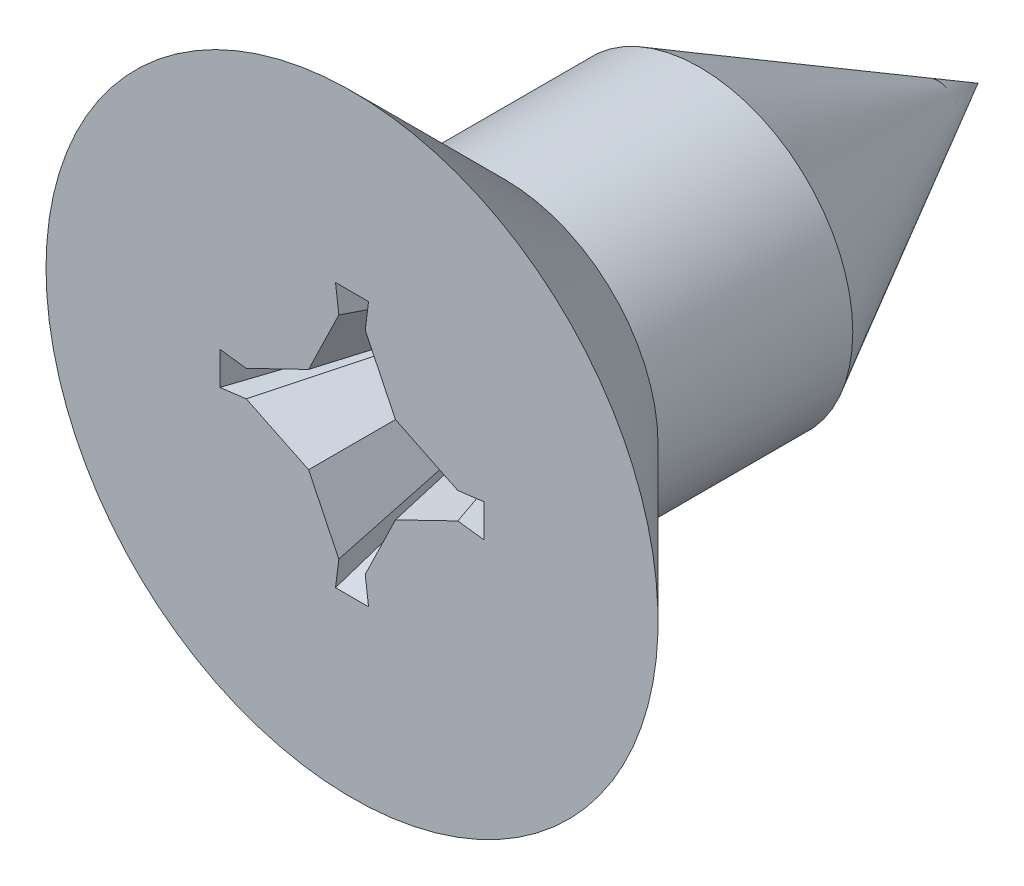
ISO-10303-21;
HEADER;
FILE_DESCRIPTION(('STEP AP214'),'2;1');
FILE_NAME('part.step','',(''),(''),'','','');
FILE_SCHEMA(('AUTOMOTIVE_DESIGN { 1 0 10303 214 1 1 1 1 }'));
ENDSEC;
DATA;
#1=APPLICATION_CONTEXT('core data for automotive mechanical design processes');
#2=APPLICATION_PROTOCOL_DEFINITION('international standard','automotive_design',2000,#1);
#3=PRODUCT_CONTEXT('',#1,'mechanical');
#4=PRODUCT('Part','Part','',(#3));
#5=PRODUCT_RELATED_PRODUCT_CATEGORY('part','',(#4));
#6=PRODUCT_DEFINITION_FORMATION('','',#4);
#7=PRODUCT_DEFINITION_CONTEXT('part definition',#1,'design');
#8=PRODUCT_DEFINITION('design','',#6,#7);
#9=PRODUCT_DEFINITION_SHAPE('','',#8);
#10=(LENGTH_UNIT() NAMED_UNIT(*) SI_UNIT(.MILLI.,.METRE.));
#11=(NAMED_UNIT(*) PLANE_ANGLE_UNIT() SI_UNIT($,.RADIAN.));
#12=(NAMED_UNIT(*) SI_UNIT($,.STERADIAN.) SOLID_ANGLE_UNIT());
#13=UNCERTAINTY_MEASURE_WITH_UNIT(LENGTH_MEASURE(1.E-05),#10,'distance_accuracy_value','');
#14=(GEOMETRIC_REPRESENTATION_CONTEXT(3) GLOBAL_UNCERTAINTY_ASSIGNED_CONTEXT((#13)) GLOBAL_UNIT_ASSIGNED_CONTEXT((#10,
#11,#12)) REPRESENTATION_CONTEXT('',''));
#15=CARTESIAN_POINT('',(0.,0.,0.));
#16=DIRECTION('',(0.,0.,1.));
#17=DIRECTION('',(1.,0.,0.));
#18=AXIS2_PLACEMENT_3D('',#15,#16,#17);
#19=CARTESIAN_POINT('',(0.,0.,1.1));
#20=DIRECTION('',(0.,0.,-1.));
#21=DIRECTION('',(-1.,0.,0.));
#22=AXIS2_PLACEMENT_3D('',#19,#20,#21);
#23=PLANE('',#22);
#24=CARTESIAN_POINT('',(0.,0.,1.1));
#25=DIRECTION('',(0.,0.,-1.));
#26=DIRECTION('',(-1.,0.,0.));
#27=AXIS2_PLACEMENT_3D('',#24,#25,#26);
#28=CIRCLE('',#27,2.2);
#29=CARTESIAN_POINT('',(-2.2,0.,1.1));
#30=VERTEX_POINT('',#29);
#31=EDGE_CURVE('E318',#30,#30,#28,.T.);
#32=ORIENTED_EDGE('',*,*,#31,.F.);
#33=EDGE_LOOP('',(#32));
#34=FACE_BOUND('',#33,.T.);
#35=DIRECTION('',(0.992277876713668,-0.124034734589208,0.));
#36=VECTOR('',#35,1.);
#37=CARTESIAN_POINT('',(0.855,-0.106875,1.1));
#38=LINE('',#37,#36);
#39=CARTESIAN_POINT('',(0.76,-0.095,1.1));
#40=VERTEX_POINT('',#39);
#41=CARTESIAN_POINT('',(0.95,-0.11875,1.1));
#42=VERTEX_POINT('',#41);
#43=EDGE_CURVE('E316',#40,#42,#38,.T.);
#44=ORIENTED_EDGE('',*,*,#43,.F.);
#45=DIRECTION('',(0.899748408578143,0.4364089839372,0.));
#46=VECTOR('',#45,1.);
#47=CARTESIAN_POINT('',(0.536099471867573,-0.203599471867572,1.1));
#48=LINE('',#47,#46);
#49=CARTESIAN_POINT('',(0.312198943735145,-0.312198943735145,1.1));
#50=VERTEX_POINT('',#49);
#51=EDGE_CURVE('E309',#50,#40,#48,.T.);
#52=ORIENTED_EDGE('',*,*,#51,.F.);
#53=DIRECTION('',(0.4364089839372,0.899748408578143,0.));
#54=VECTOR('',#53,1.);
#55=CARTESIAN_POINT('',(0.203599471867572,-0.536099471867573,1.1));
#56=LINE('',#55,#54);
#57=CARTESIAN_POINT('',(0.095,-0.76,1.1));
#58=VERTEX_POINT('',#57);
#59=EDGE_CURVE('E32',#58,#50,#56,.T.);
#60=ORIENTED_EDGE('',*,*,#59,.F.);
#61=DIRECTION('',(-0.124034734589209,0.992277876713668,0.));
#62=VECTOR('',#61,1.);
#63=CARTESIAN_POINT('',(0.106875,-0.855,1.1));
#64=LINE('',#63,#62);
#65=CARTESIAN_POINT('',(0.11875,-0.95,1.1));
#66=VERTEX_POINT('',#65);
#67=EDGE_CURVE('E295',#66,#58,#64,.T.);
#68=ORIENTED_EDGE('',*,*,#67,.F.);
#69=DIRECTION('',(1.,0.,0.));
#70=VECTOR('',#69,1.);
#71=CARTESIAN_POINT('',(-0.059375,-0.95,1.1));
#72=LINE('',#71,#70);
#73=CARTESIAN_POINT('',(-0.11875,-0.95,1.1));
#74=VERTEX_POINT('',#73);
#75=EDGE_CURVE('E285',#74,#66,#72,.T.);
#76=ORIENTED_EDGE('',*,*,#75,.F.);
#77=DIRECTION('',(-0.124034734589209,-0.992277876713668,0.));
#78=VECTOR('',#77,1.);
#79=CARTESIAN_POINT('',(-0.106875,-0.855,1.1));
#80=LINE('',#79,#78);
#81=CARTESIAN_POINT('',(-0.095,-0.76,1.1));
#82=VERTEX_POINT('',#81);
#83=EDGE_CURVE('E280',#82,#74,#80,.T.);
#84=ORIENTED_EDGE('',*,*,#83,.F.);
#85=DIRECTION('',(0.4364089839372,-0.899748408578143,0.));
#86=VECTOR('',#85,1.);
#87=CARTESIAN_POINT('',(-0.203599471867572,-0.536099471867573,1.1));
#88=LINE('',#87,#86);
#89=CARTESIAN_POINT('',(-0.312198943735145,-0.312198943735145,1.1));
#90=VERTEX_POINT('',#89);
#91=EDGE_CURVE('E272',#90,#82,#88,.T.);
#92=ORIENTED_EDGE('',*,*,#91,.F.);
#93=DIRECTION('',(0.899748408578143,-0.4364089839372,0.));
#94=VECTOR('',#93,1.);
#95=CARTESIAN_POINT('',(-0.536099471867573,-0.203599471867572,1.1));
#96=LINE('',#95,#94);
#97=CARTESIAN_POINT('',(-0.76,-0.095,1.1));
#98=VERTEX_POINT('',#97);
#99=EDGE_CURVE('E264',#98,#90,#96,.T.);
#100=ORIENTED_EDGE('',*,*,#99,.F.);
#101=DIRECTION('',(0.992277876713668,0.124034734589208,0.));
#102=VECTOR('',#101,1.);
#103=CARTESIAN_POINT('',(-0.855,-0.106875,1.1));
#104=LINE('',#103,#102);
#105=CARTESIAN_POINT('',(-0.95,-0.11875,1.1));
#106=VERTEX_POINT('',#105);
#107=EDGE_CURVE('E256',#106,#98,#104,.T.);
#108=ORIENTED_EDGE('',*,*,#107,.F.);
#109=DIRECTION('',(0.,-1.,0.));
#110=VECTOR('',#109,1.);
#111=CARTESIAN_POINT('',(-0.95,0.059375,1.1));
#112=LINE('',#111,#110);
#113=CARTESIAN_POINT('',(-0.95,0.11875,1.1));
#114=VERTEX_POINT('',#113);
#115=EDGE_CURVE('E246',#114,#106,#112,.T.);
#116=ORIENTED_EDGE('',*,*,#115,.F.);
#117=DIRECTION('',(-0.992277876713668,0.124034734589208,0.));
#118=VECTOR('',#117,1.);
#119=CARTESIAN_POINT('',(-0.855,0.106875,1.1));
#120=LINE('',#119,#118);
#121=CARTESIAN_POINT('',(-0.76,0.095,1.1));
#122=VERTEX_POINT('',#121);
#123=EDGE_CURVE('E241',#122,#114,#120,.T.);
#124=ORIENTED_EDGE('',*,*,#123,.F.);
#125=DIRECTION('',(-0.899748408578143,-0.4364089839372,0.));
#126=VECTOR('',#125,1.);
#127=CARTESIAN_POINT('',(-0.536099471867573,0.203599471867572,1.1));
#128=LINE('',#127,#126);
#129=CARTESIAN_POINT('',(-0.312198943735145,0.312198943735145,1.1));
#130=VERTEX_POINT('',#129);
#131=EDGE_CURVE('E233',#130,#122,#128,.T.);
#132=ORIENTED_EDGE('',*,*,#131,.F.);
#133=DIRECTION('',(-0.4364089839372,-0.899748408578143,0.));
#134=VECTOR('',#133,1.);
#135=CARTESIAN_POINT('',(-0.203599471867572,0.536099471867573,1.1));
#136=LINE('',#135,#134);
#137=CARTESIAN_POINT('',(-0.095,0.76,1.1));
#138=VERTEX_POINT('',#137);
#139=EDGE_CURVE('E225',#138,#130,#136,.T.);
#140=ORIENTED_EDGE('',*,*,#139,.F.);
#141=DIRECTION('',(0.124034734589209,-0.992277876713668,0.));
#142=VECTOR('',#141,1.);
#143=CARTESIAN_POINT('',(-0.106875,0.855,1.1));
#144=LINE('',#143,#142);
#145=CARTESIAN_POINT('',(-0.11875,0.95,1.1));
#146=VERTEX_POINT('',#145);
#147=EDGE_CURVE('E217',#146,#138,#144,.T.);
#148=ORIENTED_EDGE('',*,*,#147,.F.);
#149=DIRECTION('',(-1.,0.,0.));
#150=VECTOR('',#149,1.);
#151=CARTESIAN_POINT('',(0.059375,0.95,1.1));
#152=LINE('',#151,#150);
#153=CARTESIAN_POINT('',(0.11875,0.95,1.1));
#154=VERTEX_POINT('',#153);
#155=EDGE_CURVE('E207',#154,#146,#152,.T.);
#156=ORIENTED_EDGE('',*,*,#155,.F.);
#157=DIRECTION('',(0.124034734589209,0.992277876713668,0.));
#158=VECTOR('',#157,1.);
#159=CARTESIAN_POINT('',(0.106875,0.855,1.1));
#160=LINE('',#159,#158);
#161=CARTESIAN_POINT('',(0.095,0.76,1.1));
#162=VERTEX_POINT('',#161);
#163=EDGE_CURVE('E202',#162,#154,#160,.T.);
#164=ORIENTED_EDGE('',*,*,#163,.F.);
#165=DIRECTION('',(-0.4364089839372,0.899748408578143,0.));
#166=VECTOR('',#165,1.);
#167=CARTESIAN_POINT('',(0.203599471867572,0.536099471867573,1.1));
#168=LINE('',#167,#166);
#169=CARTESIAN_POINT('',(0.312198943735145,0.312198943735145,1.1));
#170=VERTEX_POINT('',#169);
#171=EDGE_CURVE('E194',#170,#162,#168,.T.);
#172=ORIENTED_EDGE('',*,*,#171,.F.);
#173=DIRECTION('',(-0.899748408578143,0.4364089839372,0.));
#174=VECTOR('',#173,1.);
#175=CARTESIAN_POINT('',(0.536099471867573,0.203599471867572,1.1));
#176=LINE('',#175,#174);
#177=CARTESIAN_POINT('',(0.76,0.095,1.1));
#178=VERTEX_POINT('',#177);
#179=EDGE_CURVE('E177',#178,#170,#176,.T.);
#180=ORIENTED_EDGE('',*,*,#179,.F.);
#181=DIRECTION('',(-0.992277876713668,-0.124034734589208,0.));
#182=VECTOR('',#181,1.);
#183=CARTESIAN_POINT('',(0.855,0.106875,1.1));
#184=LINE('',#183,#182);
#185=CARTESIAN_POINT('',(0.95,0.11875,1.1));
#186=VERTEX_POINT('',#185);
#187=EDGE_CURVE('E169',#186,#178,#184,.T.);
#188=ORIENTED_EDGE('',*,*,#187,.F.);
#189=DIRECTION('',(0.,1.,0.));
#190=VECTOR('',#189,1.);
#191=CARTESIAN_POINT('',(0.95,0.059375,1.1));
#192=LINE('',#191,#190);
#193=EDGE_CURVE('E155',#42,#186,#192,.T.);
#194=ORIENTED_EDGE('',*,*,#193,.F.);
#195=EDGE_LOOP('',(#44,#52,#60,#68,#76,#84,#92,#100,#108,#116,#124,#132,#140,#148,#156,#164,
#172,#180,#188,#194));
#196=FACE_BOUND('',#195,.T.);
#197=ADVANCED_FACE('F17',(#34,#196),#23,.F.);
#198=CARTESIAN_POINT('',(0.,0.,1.1));
#199=DIRECTION('',(0.,0.,1.));
#200=DIRECTION('',(1.,0.,0.));
#201=AXIS2_PLACEMENT_3D('',#198,#199,#200);
#202=CONICAL_SURFACE('',#201,2.2,0.785398163397448);
#203=CARTESIAN_POINT('',(0.,0.,0.));
#204=DIRECTION('',(0.,0.,-1.));
#205=DIRECTION('',(-1.,0.,0.));
#206=AXIS2_PLACEMENT_3D('',#203,#204,#205);
#207=CIRCLE('',#206,1.1);
#208=CARTESIAN_POINT('',(-1.1,0.,0.));
#209=VERTEX_POINT('',#208);
#210=EDGE_CURVE('E11',#209,#209,#207,.T.);
#211=ORIENTED_EDGE('',*,*,#210,.F.);
#212=EDGE_LOOP('',(#211));
#213=FACE_BOUND('',#212,.T.);
#214=ORIENTED_EDGE('',*,*,#31,.T.);
#215=EDGE_LOOP('',(#214));
#216=FACE_BOUND('',#215,.T.);
#217=ADVANCED_FACE('F19',(#213,#216),#202,.T.);
#218=CARTESIAN_POINT('',(0.,0.,0.));
#219=DIRECTION('',(0.,0.,-1.));
#220=DIRECTION('',(-1.,0.,0.));
#221=AXIS2_PLACEMENT_3D('',#218,#219,#220);
#222=CYLINDRICAL_SURFACE('',#221,1.1);
#223=CARTESIAN_POINT('',(0.,0.,-1.4));
#224=DIRECTION('',(0.,0.,-1.));
#225=DIRECTION('',(-1.,0.,0.));
#226=AXIS2_PLACEMENT_3D('',#223,#224,#225);
#227=CIRCLE('',#226,1.1);
#228=CARTESIAN_POINT('',(-1.1,0.,-1.4));
#229=VERTEX_POINT('',#228);
#230=EDGE_CURVE('E25',#229,#229,#227,.T.);
#231=ORIENTED_EDGE('',*,*,#230,.F.);
#232=EDGE_LOOP('',(#231));
#233=FACE_BOUND('',#232,.T.);
#234=ORIENTED_EDGE('',*,*,#210,.T.);
#235=EDGE_LOOP('',(#234));
#236=FACE_BOUND('',#235,.T.);
#237=ADVANCED_FACE('F325',(#233,#236),#222,.T.);
#238=CARTESIAN_POINT('',(0.,0.,-1.4));
#239=DIRECTION('',(0.,0.,1.));
#240=DIRECTION('',(1.,0.,0.));
#241=AXIS2_PLACEMENT_3D('',#238,#239,#240);
#242=CONICAL_SURFACE('',#241,1.1,0.502843210927861);
#243=CARTESIAN_POINT('',(0.,0.,-3.4));
#244=VERTEX_POINT('',#243);
#245=VERTEX_LOOP('',#244);
#246=FACE_BOUND('',#245,.T.);
#247=ORIENTED_EDGE('',*,*,#230,.T.);
#248=EDGE_LOOP('',(#247));
#249=FACE_BOUND('',#248,.T.);
#250=ADVANCED_FACE('F323',(#246,#249),#242,.T.);
#251=CARTESIAN_POINT('',(0.7125,-0.0890625000000011,0.5));
#252=DIRECTION('',(0.124034734589204,0.992277876713668,0.));
#253=DIRECTION('',(-0.992277876713668,0.124034734589204,0.));
#254=AXIS2_PLACEMENT_3D('',#251,#252,#253);
#255=PLANE('',#254);
#256=DIRECTION('',(-0.301676980969557,0.0377096226211937,-0.952664150430182));
#257=VECTOR('',#256,1.);
#258=CARTESIAN_POINT('',(0.57,-0.0712500000000009,0.5));
#259=LINE('',#258,#257);
#260=CARTESIAN_POINT('',(0.38,-0.0475000000000015,-0.0999999999999985));
#261=VERTEX_POINT('',#260);
#262=EDGE_CURVE('E307',#40,#261,#259,.T.);
#263=ORIENTED_EDGE('',*,*,#262,.F.);
#264=ORIENTED_EDGE('',*,*,#43,.T.);
#265=DIRECTION('',(-0.367659570410893,0.0459574463013603,-0.928824177880149));
#266=VECTOR('',#265,1.);
#267=CARTESIAN_POINT('',(0.7125,-0.0890625000000011,0.5));
#268=LINE('',#267,#266);
#269=CARTESIAN_POINT('',(0.475,-0.0593750000000018,-0.0999999999999985));
#270=VERTEX_POINT('',#269);
#271=EDGE_CURVE('E161',#42,#270,#268,.T.);
#272=ORIENTED_EDGE('',*,*,#271,.T.);
#273=DIRECTION('',(0.992277876713667,-0.124034734589212,0.));
#274=VECTOR('',#273,1.);
#275=CARTESIAN_POINT('',(0.4275,-0.0534375000000017,-0.0999999999999985));
#276=LINE('',#275,#274);
#277=EDGE_CURVE('E312',#261,#270,#276,.T.);
#278=ORIENTED_EDGE('',*,*,#277,.F.);
#279=EDGE_LOOP('',(#263,#264,#272,#278));
#280=FACE_BOUND('',#279,.T.);
#281=ADVANCED_FACE('F341',(#280),#255,.T.);
#282=CARTESIAN_POINT('',(0.57,-0.0712500000000009,0.5));
#283=DIRECTION('',(-0.429962649260618,0.886457941195704,0.171243799104858));
#284=DIRECTION('',(-0.899748408578141,-0.436408983937203,0.));
#285=AXIS2_PLACEMENT_3D('',#282,#283,#284);
#286=PLANE('',#285);
#287=DIRECTION('',(-0.127936029151139,0.127936029151139,-0.983496184481708));
#288=VECTOR('',#287,1.);
#289=CARTESIAN_POINT('',(0.234149207801359,-0.234149207801359,0.5));
#290=LINE('',#289,#288);
#291=CARTESIAN_POINT('',(0.156099471867573,-0.156099471867573,-0.0999999999999985));
#292=VERTEX_POINT('',#291);
#293=EDGE_CURVE('E301',#50,#292,#290,.T.);
#294=ORIENTED_EDGE('',*,*,#293,.F.);
#295=ORIENTED_EDGE('',*,*,#51,.T.);
#296=ORIENTED_EDGE('',*,*,#262,.T.);
#297=DIRECTION('',(0.899748408578144,0.436408983937197,0.));
#298=VECTOR('',#297,1.);
#299=CARTESIAN_POINT('',(0.268049735933787,-0.101799735933787,-0.0999999999999985));
#300=LINE('',#299,#298);
#301=EDGE_CURVE('E304',#292,#261,#300,.T.);
#302=ORIENTED_EDGE('',*,*,#301,.F.);
#303=EDGE_LOOP('',(#294,#295,#296,#302));
#304=FACE_BOUND('',#303,.T.);
#305=ADVANCED_FACE('F347',(#304),#286,.T.);
#306=CARTESIAN_POINT('',(0.07125,-0.57,0.5));
#307=DIRECTION('',(-0.886457941195705,0.429962649260615,0.171243799104858));
#308=DIRECTION('',(-0.4364089839372,-0.899748408578143,0.));
#309=AXIS2_PLACEMENT_3D('',#306,#307,#308);
#310=PLANE('',#309);
#311=DIRECTION('',(-0.0377096226211946,0.301676980969557,-0.952664150430182));
#312=VECTOR('',#311,1.);
#313=CARTESIAN_POINT('',(0.07125,-0.57,0.5));
#314=LINE('',#313,#312);
#315=CARTESIAN_POINT('',(0.0475,-0.38,-0.0999999999999985));
#316=VERTEX_POINT('',#315);
#317=EDGE_CURVE('E293',#58,#316,#314,.T.);
#318=ORIENTED_EDGE('',*,*,#317,.F.);
#319=ORIENTED_EDGE('',*,*,#59,.T.);
#320=ORIENTED_EDGE('',*,*,#293,.T.);
#321=DIRECTION('',(0.4364089839372,0.899748408578143,0.));
#322=VECTOR('',#321,1.);
#323=CARTESIAN_POINT('',(0.101799735933786,-0.268049735933787,-0.0999999999999985));
#324=LINE('',#323,#322);
#325=EDGE_CURVE('E298',#316,#292,#324,.T.);
#326=ORIENTED_EDGE('',*,*,#325,.F.);
#327=EDGE_LOOP('',(#318,#319,#320,#326));
#328=FACE_BOUND('',#327,.T.);
#329=ADVANCED_FACE('F352',(#328),#310,.T.);
#330=CARTESIAN_POINT('',(0.0890625,-0.7125,0.5));
#331=DIRECTION('',(-0.992277876713668,-0.12403473458921,0.));
#332=DIRECTION('',(0.12403473458921,-0.992277876713668,0.));
#333=AXIS2_PLACEMENT_3D('',#330,#331,#332);
#334=PLANE('',#333);
#335=DIRECTION('',(-0.0459574463013616,0.367659570410892,-0.928824177880149));
#336=VECTOR('',#335,1.);
#337=CARTESIAN_POINT('',(0.0890625,-0.7125,0.5));
#338=LINE('',#337,#336);
#339=CARTESIAN_POINT('',(0.059375,-0.475,-0.0999999999999985));
#340=VERTEX_POINT('',#339);
#341=EDGE_CURVE('E287',#66,#340,#338,.T.);
#342=ORIENTED_EDGE('',*,*,#341,.F.);
#343=ORIENTED_EDGE('',*,*,#67,.T.);
#344=ORIENTED_EDGE('',*,*,#317,.T.);
#345=DIRECTION('',(-0.124034734589208,0.992277876713668,0.));
#346=VECTOR('',#345,1.);
#347=CARTESIAN_POINT('',(0.0534375,-0.4275,-0.0999999999999985));
#348=LINE('',#347,#346);
#349=EDGE_CURVE('E290',#340,#316,#348,.T.);
#350=ORIENTED_EDGE('',*,*,#349,.F.);
#351=EDGE_LOOP('',(#342,#343,#344,#350));
#352=FACE_BOUND('',#351,.T.);
#353=ADVANCED_FACE('F362',(#352),#334,.T.);
#354=CARTESIAN_POINT('',(-0.0890625,-0.7125,0.5));
#355=DIRECTION('',(0.,0.929806613071272,0.368048451007378));
#356=DIRECTION('',(0.,-0.368048451007378,0.929806613071272));
#357=AXIS2_PLACEMENT_3D('',#354,#355,#356);
#358=PLANE('',#357);
#359=DIRECTION('',(0.0459574463013616,0.367659570410892,-0.928824177880149));
#360=VECTOR('',#359,1.);
#361=CARTESIAN_POINT('',(-0.0890625,-0.7125,0.5));
#362=LINE('',#361,#360);
#363=CARTESIAN_POINT('',(-0.059375,-0.475,-0.0999999999999985));
#364=VERTEX_POINT('',#363);
#365=EDGE_CURVE('E278',#74,#364,#362,.T.);
#366=ORIENTED_EDGE('',*,*,#365,.F.);
#367=ORIENTED_EDGE('',*,*,#75,.T.);
#368=ORIENTED_EDGE('',*,*,#341,.T.);
#369=DIRECTION('',(1.,0.,0.));
#370=VECTOR('',#369,1.);
#371=CARTESIAN_POINT('',(-0.0296875,-0.475,-0.0999999999999985));
#372=LINE('',#371,#370);
#373=EDGE_CURVE('E283',#364,#340,#372,.T.);
#374=ORIENTED_EDGE('',*,*,#373,.F.);
#375=EDGE_LOOP('',(#366,#367,#368,#374));
#376=FACE_BOUND('',#375,.T.);
#377=ADVANCED_FACE('F366',(#376),#358,.T.);
#378=CARTESIAN_POINT('',(-0.0890625,-0.7125,0.5));
#379=DIRECTION('',(0.992277876713668,-0.124034734589209,0.));
#380=DIRECTION('',(0.124034734589209,0.992277876713668,0.));
#381=AXIS2_PLACEMENT_3D('',#378,#379,#380);
#382=PLANE('',#381);
#383=DIRECTION('',(0.0377096226211946,0.301676980969557,-0.952664150430182));
#384=VECTOR('',#383,1.);
#385=CARTESIAN_POINT('',(-0.07125,-0.57,0.5));
#386=LINE('',#385,#384);
#387=CARTESIAN_POINT('',(-0.0475,-0.38,-0.0999999999999985));
#388=VERTEX_POINT('',#387);
#389=EDGE_CURVE('E270',#82,#388,#386,.T.);
#390=ORIENTED_EDGE('',*,*,#389,.F.);
#391=ORIENTED_EDGE('',*,*,#83,.T.);
#392=ORIENTED_EDGE('',*,*,#365,.T.);
#393=DIRECTION('',(-0.124034734589208,-0.992277876713668,0.));
#394=VECTOR('',#393,1.);
#395=CARTESIAN_POINT('',(-0.0534375,-0.4275,-0.0999999999999985));
#396=LINE('',#395,#394);
#397=EDGE_CURVE('E275',#388,#364,#396,.T.);
#398=ORIENTED_EDGE('',*,*,#397,.F.);
#399=EDGE_LOOP('',(#390,#391,#392,#398));
#400=FACE_BOUND('',#399,.T.);
#401=ADVANCED_FACE('F369',(#400),#382,.T.);
#402=CARTESIAN_POINT('',(-0.07125,-0.57,0.5));
#403=DIRECTION('',(0.886457941195705,0.429962649260615,0.171243799104858));
#404=DIRECTION('',(-0.4364089839372,0.899748408578143,0.));
#405=AXIS2_PLACEMENT_3D('',#402,#403,#404);
#406=PLANE('',#405);
#407=DIRECTION('',(0.127936029151139,0.127936029151139,-0.983496184481708));
#408=VECTOR('',#407,1.);
#409=CARTESIAN_POINT('',(-0.234149207801359,-0.234149207801359,0.5));
#410=LINE('',#409,#408);
#411=CARTESIAN_POINT('',(-0.156099471867573,-0.156099471867573,-0.0999999999999985));
#412=VERTEX_POINT('',#411);
#413=EDGE_CURVE('E262',#90,#412,#410,.T.);
#414=ORIENTED_EDGE('',*,*,#413,.F.);
#415=ORIENTED_EDGE('',*,*,#91,.T.);
#416=ORIENTED_EDGE('',*,*,#389,.T.);
#417=DIRECTION('',(0.4364089839372,-0.899748408578143,0.));
#418=VECTOR('',#417,1.);
#419=CARTESIAN_POINT('',(-0.101799735933786,-0.268049735933787,-0.0999999999999985));
#420=LINE('',#419,#418);
#421=EDGE_CURVE('E267',#412,#388,#420,.T.);
#422=ORIENTED_EDGE('',*,*,#421,.F.);
#423=EDGE_LOOP('',(#414,#415,#416,#422));
#424=FACE_BOUND('',#423,.T.);
#425=ADVANCED_FACE('F374',(#424),#406,.T.);
#426=CARTESIAN_POINT('',(-0.57,-0.0712500000000009,0.5));
#427=DIRECTION('',(0.429962649260618,0.886457941195704,0.171243799104858));
#428=DIRECTION('',(-0.899748408578141,0.436408983937203,0.));
#429=AXIS2_PLACEMENT_3D('',#426,#427,#428);
#430=PLANE('',#429);
#431=DIRECTION('',(0.301676980969557,0.0377096226211937,-0.952664150430182));
#432=VECTOR('',#431,1.);
#433=CARTESIAN_POINT('',(-0.57,-0.0712500000000009,0.5));
#434=LINE('',#433,#432);
#435=CARTESIAN_POINT('',(-0.38,-0.0475000000000015,-0.0999999999999985));
#436=VERTEX_POINT('',#435);
#437=EDGE_CURVE('E254',#98,#436,#434,.T.);
#438=ORIENTED_EDGE('',*,*,#437,.F.);
#439=ORIENTED_EDGE('',*,*,#99,.T.);
#440=ORIENTED_EDGE('',*,*,#413,.T.);
#441=DIRECTION('',(0.899748408578144,-0.436408983937197,0.));
#442=VECTOR('',#441,1.);
#443=CARTESIAN_POINT('',(-0.268049735933787,-0.101799735933787,-0.0999999999999985));
#444=LINE('',#443,#442);
#445=EDGE_CURVE('E259',#436,#412,#444,.T.);
#446=ORIENTED_EDGE('',*,*,#445,.F.);
#447=EDGE_LOOP('',(#438,#439,#440,#446));
#448=FACE_BOUND('',#447,.T.);
#449=ADVANCED_FACE('F378',(#448),#430,.T.);
#450=CARTESIAN_POINT('',(-0.7125,-0.0890625000000011,0.5));
#451=DIRECTION('',(-0.124034734589204,0.992277876713668,0.));
#452=DIRECTION('',(-0.992277876713668,-0.124034734589204,0.));
#453=AXIS2_PLACEMENT_3D('',#450,#451,#452);
#454=PLANE('',#453);
#455=DIRECTION('',(0.367659570410893,0.0459574463013603,-0.928824177880149));
#456=VECTOR('',#455,1.);
#457=CARTESIAN_POINT('',(-0.7125,-0.0890625000000011,0.5));
#458=LINE('',#457,#456);
#459=CARTESIAN_POINT('',(-0.475,-0.0593750000000018,-0.0999999999999985));
#460=VERTEX_POINT('',#459);
#461=EDGE_CURVE('E248',#106,#460,#458,.T.);
#462=ORIENTED_EDGE('',*,*,#461,.F.);
#463=ORIENTED_EDGE('',*,*,#107,.T.);
#464=ORIENTED_EDGE('',*,*,#437,.T.);
#465=DIRECTION('',(0.992277876713667,0.124034734589212,0.));
#466=VECTOR('',#465,1.);
#467=CARTESIAN_POINT('',(-0.4275,-0.0534375000000017,-0.0999999999999985));
#468=LINE('',#467,#466);
#469=EDGE_CURVE('E251',#460,#436,#468,.T.);
#470=ORIENTED_EDGE('',*,*,#469,.F.);
#471=EDGE_LOOP('',(#462,#463,#464,#470));
#472=FACE_BOUND('',#471,.T.);
#473=ADVANCED_FACE('F382',(#472),#454,.T.);
#474=CARTESIAN_POINT('',(-0.7125,0.0890625000000011,0.5));
#475=DIRECTION('',(0.929806613071272,0.,0.368048451007378));
#476=DIRECTION('',(0.368048451007378,0.,-0.929806613071272));
#477=AXIS2_PLACEMENT_3D('',#474,#475,#476);
#478=PLANE('',#477);
#479=DIRECTION('',(0.367659570410893,-0.0459574463013603,-0.928824177880149));
#480=VECTOR('',#479,1.);
#481=CARTESIAN_POINT('',(-0.7125,0.089062500000001,0.5));
#482=LINE('',#481,#480);
#483=CARTESIAN_POINT('',(-0.475,0.0593750000000018,-0.0999999999999985));
#484=VERTEX_POINT('',#483);
#485=EDGE_CURVE('E239',#114,#484,#482,.T.);
#486=ORIENTED_EDGE('',*,*,#485,.F.);
#487=ORIENTED_EDGE('',*,*,#115,.T.);
#488=ORIENTED_EDGE('',*,*,#461,.T.);
#489=DIRECTION('',(0.,-1.,0.));
#490=VECTOR('',#489,1.);
#491=CARTESIAN_POINT('',(-0.475,0.0296875,-0.0999999999999985));
#492=LINE('',#491,#490);
#493=EDGE_CURVE('E244',#484,#460,#492,.T.);
#494=ORIENTED_EDGE('',*,*,#493,.F.);
#495=EDGE_LOOP('',(#486,#487,#488,#494));
#496=FACE_BOUND('',#495,.T.);
#497=ADVANCED_FACE('F387',(#496),#478,.T.);
#498=CARTESIAN_POINT('',(-0.7125,0.089062500000001,0.5));
#499=DIRECTION('',(-0.124034734589204,-0.992277876713668,0.));
#500=DIRECTION('',(0.992277876713668,-0.124034734589204,0.));
#501=AXIS2_PLACEMENT_3D('',#498,#499,#500);
#502=PLANE('',#501);
#503=DIRECTION('',(0.301676980969557,-0.0377096226211937,-0.952664150430182));
#504=VECTOR('',#503,1.);
#505=CARTESIAN_POINT('',(-0.57,0.0712500000000009,0.5));
#506=LINE('',#505,#504);
#507=CARTESIAN_POINT('',(-0.38,0.0475000000000015,-0.0999999999999985));
#508=VERTEX_POINT('',#507);
#509=EDGE_CURVE('E231',#122,#508,#506,.T.);
#510=ORIENTED_EDGE('',*,*,#509,.F.);
#511=ORIENTED_EDGE('',*,*,#123,.T.);
#512=ORIENTED_EDGE('',*,*,#485,.T.);
#513=DIRECTION('',(-0.992277876713667,0.124034734589212,0.));
#514=VECTOR('',#513,1.);
#515=CARTESIAN_POINT('',(-0.4275,0.0534375000000017,-0.0999999999999985));
#516=LINE('',#515,#514);
#517=EDGE_CURVE('E236',#508,#484,#516,.T.);
#518=ORIENTED_EDGE('',*,*,#517,.F.);
#519=EDGE_LOOP('',(#510,#511,#512,#518));
#520=FACE_BOUND('',#519,.T.);
#521=ADVANCED_FACE('F391',(#520),#502,.T.);
#522=CARTESIAN_POINT('',(-0.57,0.0712500000000009,0.5));
#523=DIRECTION('',(0.429962649260618,-0.886457941195704,0.171243799104858));
#524=DIRECTION('',(0.899748408578141,0.436408983937203,0.));
#525=AXIS2_PLACEMENT_3D('',#522,#523,#524);
#526=PLANE('',#525);
#527=DIRECTION('',(0.127936029151139,-0.127936029151139,-0.983496184481708));
#528=VECTOR('',#527,1.);
#529=CARTESIAN_POINT('',(-0.234149207801359,0.234149207801359,0.5));
#530=LINE('',#529,#528);
#531=CARTESIAN_POINT('',(-0.156099471867573,0.156099471867573,-0.0999999999999985));
#532=VERTEX_POINT('',#531);
#533=EDGE_CURVE('E223',#130,#532,#530,.T.);
#534=ORIENTED_EDGE('',*,*,#533,.F.);
#535=ORIENTED_EDGE('',*,*,#131,.T.);
#536=ORIENTED_EDGE('',*,*,#509,.T.);
#537=DIRECTION('',(-0.899748408578144,-0.436408983937197,0.));
#538=VECTOR('',#537,1.);
#539=CARTESIAN_POINT('',(-0.268049735933787,0.101799735933787,-0.0999999999999985));
#540=LINE('',#539,#538);
#541=EDGE_CURVE('E228',#532,#508,#540,.T.);
#542=ORIENTED_EDGE('',*,*,#541,.F.);
#543=EDGE_LOOP('',(#534,#535,#536,#542));
#544=FACE_BOUND('',#543,.T.);
#545=ADVANCED_FACE('F394',(#544),#526,.T.);
#546=CARTESIAN_POINT('',(-0.07125,0.57,0.5));
#547=DIRECTION('',(0.886457941195705,-0.429962649260615,0.171243799104858));
#548=DIRECTION('',(0.4364089839372,0.899748408578143,0.));
#549=AXIS2_PLACEMENT_3D('',#546,#547,#548);
#550=PLANE('',#549);
#551=DIRECTION('',(0.0377096226211946,-0.301676980969557,-0.952664150430182));
#552=VECTOR('',#551,1.);
#553=CARTESIAN_POINT('',(-0.07125,0.57,0.5));
#554=LINE('',#553,#552);
#555=CARTESIAN_POINT('',(-0.0475,0.38,-0.0999999999999985));
#556=VERTEX_POINT('',#555);
#557=EDGE_CURVE('E215',#138,#556,#554,.T.);
#558=ORIENTED_EDGE('',*,*,#557,.F.);
#559=ORIENTED_EDGE('',*,*,#139,.T.);
#560=ORIENTED_EDGE('',*,*,#533,.T.);
#561=DIRECTION('',(-0.4364089839372,-0.899748408578143,0.));
#562=VECTOR('',#561,1.);
#563=CARTESIAN_POINT('',(-0.101799735933786,0.268049735933787,-0.0999999999999985));
#564=LINE('',#563,#562);
#565=EDGE_CURVE('E220',#556,#532,#564,.T.);
#566=ORIENTED_EDGE('',*,*,#565,.F.);
#567=EDGE_LOOP('',(#558,#559,#560,#566));
#568=FACE_BOUND('',#567,.T.);
#569=ADVANCED_FACE('F399',(#568),#550,.T.);
#570=CARTESIAN_POINT('',(-0.0890625,0.7125,0.5));
#571=DIRECTION('',(0.992277876713668,0.124034734589209,0.));
#572=DIRECTION('',(-0.124034734589209,0.992277876713668,0.));
#573=AXIS2_PLACEMENT_3D('',#570,#571,#572);
#574=PLANE('',#573);
#575=DIRECTION('',(0.0459574463013616,-0.367659570410892,-0.928824177880149));
#576=VECTOR('',#575,1.);
#577=CARTESIAN_POINT('',(-0.0890625,0.7125,0.5));
#578=LINE('',#577,#576);
#579=CARTESIAN_POINT('',(-0.059375,0.475,-0.0999999999999985));
#580=VERTEX_POINT('',#579);
#581=EDGE_CURVE('E209',#146,#580,#578,.T.);
#582=ORIENTED_EDGE('',*,*,#581,.F.);
#583=ORIENTED_EDGE('',*,*,#147,.T.);
#584=ORIENTED_EDGE('',*,*,#557,.T.);
#585=DIRECTION('',(0.124034734589208,-0.992277876713668,0.));
#586=VECTOR('',#585,1.);
#587=CARTESIAN_POINT('',(-0.0534375,0.4275,-0.0999999999999985));
#588=LINE('',#587,#586);
#589=EDGE_CURVE('E212',#580,#556,#588,.T.);
#590=ORIENTED_EDGE('',*,*,#589,.F.);
#591=EDGE_LOOP('',(#582,#583,#584,#590));
#592=FACE_BOUND('',#591,.T.);
#593=ADVANCED_FACE('F404',(#592),#574,.T.);
#594=CARTESIAN_POINT('',(0.0890625,0.7125,0.5));
#595=DIRECTION('',(0.,-0.929806613071272,0.368048451007378));
#596=DIRECTION('',(0.,-0.368048451007378,-0.929806613071272));
#597=AXIS2_PLACEMENT_3D('',#594,#595,#596);
#598=PLANE('',#597);
#599=DIRECTION('',(-0.0459574463013616,-0.367659570410892,-0.928824177880149));
#600=VECTOR('',#599,1.);
#601=CARTESIAN_POINT('',(0.0890625,0.7125,0.5));
#602=LINE('',#601,#600);
#603=CARTESIAN_POINT('',(0.059375,0.475,-0.0999999999999985));
#604=VERTEX_POINT('',#603);
#605=EDGE_CURVE('E200',#154,#604,#602,.T.);
#606=ORIENTED_EDGE('',*,*,#605,.F.);
#607=ORIENTED_EDGE('',*,*,#155,.T.);
#608=ORIENTED_EDGE('',*,*,#581,.T.);
#609=DIRECTION('',(-1.,0.,0.));
#610=VECTOR('',#609,1.);
#611=CARTESIAN_POINT('',(0.0296875,0.475,-0.0999999999999985));
#612=LINE('',#611,#610);
#613=EDGE_CURVE('E205',#604,#580,#612,.T.);
#614=ORIENTED_EDGE('',*,*,#613,.F.);
#615=EDGE_LOOP('',(#606,#607,#608,#614));
#616=FACE_BOUND('',#615,.T.);
#617=ADVANCED_FACE('F407',(#616),#598,.T.);
#618=CARTESIAN_POINT('',(0.0890625,0.7125,0.5));
#619=DIRECTION('',(-0.992277876713668,0.124034734589209,0.));
#620=DIRECTION('',(-0.124034734589209,-0.992277876713668,0.));
#621=AXIS2_PLACEMENT_3D('',#618,#619,#620);
#622=PLANE('',#621);
#623=DIRECTION('',(-0.0377096226211946,-0.301676980969557,-0.952664150430182));
#624=VECTOR('',#623,1.);
#625=CARTESIAN_POINT('',(0.07125,0.57,0.5));
#626=LINE('',#625,#624);
#627=CARTESIAN_POINT('',(0.0475,0.38,-0.0999999999999985));
#628=VERTEX_POINT('',#627);
#629=EDGE_CURVE('E192',#162,#628,#626,.T.);
#630=ORIENTED_EDGE('',*,*,#629,.F.);
#631=ORIENTED_EDGE('',*,*,#163,.T.);
#632=ORIENTED_EDGE('',*,*,#605,.T.);
#633=DIRECTION('',(0.124034734589208,0.992277876713668,0.));
#634=VECTOR('',#633,1.);
#635=CARTESIAN_POINT('',(0.0534375,0.4275,-0.0999999999999985));
#636=LINE('',#635,#634);
#637=EDGE_CURVE('E197',#628,#604,#636,.T.);
#638=ORIENTED_EDGE('',*,*,#637,.F.);
#639=EDGE_LOOP('',(#630,#631,#632,#638));
#640=FACE_BOUND('',#639,.T.);
#641=ADVANCED_FACE('F410',(#640),#622,.T.);
#642=CARTESIAN_POINT('',(0.07125,0.57,0.5));
#643=DIRECTION('',(-0.886457941195705,-0.429962649260615,0.171243799104858));
#644=DIRECTION('',(0.4364089839372,-0.899748408578143,0.));
#645=AXIS2_PLACEMENT_3D('',#642,#643,#644);
#646=PLANE('',#645);
#647=DIRECTION('',(-0.127936029151139,-0.127936029151139,-0.983496184481708));
#648=VECTOR('',#647,1.);
#649=CARTESIAN_POINT('',(0.234149207801359,0.234149207801359,0.5));
#650=LINE('',#649,#648);
#651=CARTESIAN_POINT('',(0.156099471867573,0.156099471867573,-0.0999999999999985));
#652=VERTEX_POINT('',#651);
#653=EDGE_CURVE('E183',#170,#652,#650,.T.);
#654=ORIENTED_EDGE('',*,*,#653,.F.);
#655=ORIENTED_EDGE('',*,*,#171,.T.);
#656=ORIENTED_EDGE('',*,*,#629,.T.);
#657=DIRECTION('',(-0.4364089839372,0.899748408578143,0.));
#658=VECTOR('',#657,1.);
#659=CARTESIAN_POINT('',(0.101799735933786,0.268049735933787,-0.0999999999999985));
#660=LINE('',#659,#658);
#661=EDGE_CURVE('E189',#652,#628,#660,.T.);
#662=ORIENTED_EDGE('',*,*,#661,.F.);
#663=EDGE_LOOP('',(#654,#655,#656,#662));
#664=FACE_BOUND('',#663,.T.);
#665=ADVANCED_FACE('F414',(#664),#646,.T.);
#666=CARTESIAN_POINT('',(0.57,0.0712500000000009,0.5));
#667=DIRECTION('',(-0.429962649260618,-0.886457941195704,0.171243799104858));
#668=DIRECTION('',(0.899748408578141,-0.436408983937203,0.));
#669=AXIS2_PLACEMENT_3D('',#666,#667,#668);
#670=PLANE('',#669);
#671=DIRECTION('',(-0.301676980969557,-0.0377096226211937,-0.952664150430182));
#672=VECTOR('',#671,1.);
#673=CARTESIAN_POINT('',(0.57,0.0712500000000009,0.5));
#674=LINE('',#673,#672);
#675=CARTESIAN_POINT('',(0.38,0.0475000000000015,-0.0999999999999985));
#676=VERTEX_POINT('',#675);
#677=EDGE_CURVE('E178',#178,#676,#674,.T.);
#678=ORIENTED_EDGE('',*,*,#677,.F.);
#679=ORIENTED_EDGE('',*,*,#179,.T.);
#680=ORIENTED_EDGE('',*,*,#653,.T.);
#681=DIRECTION('',(-0.899748408578144,0.436408983937197,0.));
#682=VECTOR('',#681,1.);
#683=CARTESIAN_POINT('',(0.268049735933787,0.101799735933787,-0.0999999999999985));
#684=LINE('',#683,#682);
#685=EDGE_CURVE('E179',#676,#652,#684,.T.);
#686=ORIENTED_EDGE('',*,*,#685,.F.);
#687=EDGE_LOOP('',(#678,#679,#680,#686));
#688=FACE_BOUND('',#687,.T.);
#689=ADVANCED_FACE('F417',(#688),#670,.T.);
#690=CARTESIAN_POINT('',(0.7125,0.0890625000000011,0.5));
#691=DIRECTION('',(0.124034734589204,-0.992277876713668,0.));
#692=DIRECTION('',(0.992277876713668,0.124034734589204,0.));
#693=AXIS2_PLACEMENT_3D('',#690,#691,#692);
#694=PLANE('',#693);
#695=DIRECTION('',(-0.367659570410893,-0.0459574463013603,-0.928824177880149));
#696=VECTOR('',#695,1.);
#697=CARTESIAN_POINT('',(0.7125,0.0890625000000011,0.5));
#698=LINE('',#697,#696);
#699=CARTESIAN_POINT('',(0.475,0.0593750000000018,-0.0999999999999985));
#700=VERTEX_POINT('',#699);
#701=EDGE_CURVE('E158',#186,#700,#698,.T.);
#702=ORIENTED_EDGE('',*,*,#701,.F.);
#703=ORIENTED_EDGE('',*,*,#187,.T.);
#704=ORIENTED_EDGE('',*,*,#677,.T.);
#705=DIRECTION('',(-0.992277876713667,-0.124034734589212,0.));
#706=VECTOR('',#705,1.);
#707=CARTESIAN_POINT('',(0.4275,0.0534375000000017,-0.0999999999999985));
#708=LINE('',#707,#706);
#709=EDGE_CURVE('E165',#700,#676,#708,.T.);
#710=ORIENTED_EDGE('',*,*,#709,.F.);
#711=EDGE_LOOP('',(#702,#703,#704,#710));
#712=FACE_BOUND('',#711,.T.);
#713=ADVANCED_FACE('F168',(#712),#694,.T.);
#714=CARTESIAN_POINT('',(0.,0.,-0.0999999999999985));
#715=DIRECTION('',(0.,0.,-1.));
#716=DIRECTION('',(-1.,0.,0.));
#717=AXIS2_PLACEMENT_3D('',#714,#715,#716);
#718=PLANE('',#717);
#719=DIRECTION('',(0.,1.,0.));
#720=VECTOR('',#719,1.);
#721=CARTESIAN_POINT('',(0.475,0.0296875000000018,-0.0999999999999985));
#722=LINE('',#721,#720);
#723=EDGE_CURVE('E172',#270,#700,#722,.T.);
#724=ORIENTED_EDGE('',*,*,#723,.T.);
#725=ORIENTED_EDGE('',*,*,#709,.T.);
#726=ORIENTED_EDGE('',*,*,#685,.T.);
#727=ORIENTED_EDGE('',*,*,#661,.T.);
#728=ORIENTED_EDGE('',*,*,#637,.T.);
#729=ORIENTED_EDGE('',*,*,#613,.T.);
#730=ORIENTED_EDGE('',*,*,#589,.T.);
#731=ORIENTED_EDGE('',*,*,#565,.T.);
#732=ORIENTED_EDGE('',*,*,#541,.T.);
#733=ORIENTED_EDGE('',*,*,#517,.T.);
#734=ORIENTED_EDGE('',*,*,#493,.T.);
#735=ORIENTED_EDGE('',*,*,#469,.T.);
#736=ORIENTED_EDGE('',*,*,#445,.T.);
#737=ORIENTED_EDGE('',*,*,#421,.T.);
#738=ORIENTED_EDGE('',*,*,#397,.T.);
#739=ORIENTED_EDGE('',*,*,#373,.T.);
#740=ORIENTED_EDGE('',*,*,#349,.T.);
#741=ORIENTED_EDGE('',*,*,#325,.T.);
#742=ORIENTED_EDGE('',*,*,#301,.T.);
#743=ORIENTED_EDGE('',*,*,#277,.T.);
#744=EDGE_LOOP('',(#724,#725,#726,#727,#728,#729,#730,#731,#732,#733,#734,#735,#736,#737,#738,
#739,#740,#741,#742,#743));
#745=FACE_BOUND('',#744,.T.);
#746=ADVANCED_FACE('F419',(#745),#718,.F.);
#747=CARTESIAN_POINT('',(0.7125,0.089062500000001,0.5));
#748=DIRECTION('',(-0.929806613071272,0.,0.368048451007378));
#749=DIRECTION('',(0.368048451007378,0.,0.929806613071272));
#750=AXIS2_PLACEMENT_3D('',#747,#748,#749);
#751=PLANE('',#750);
#752=ORIENTED_EDGE('',*,*,#193,.T.);
#753=ORIENTED_EDGE('',*,*,#701,.T.);
#754=ORIENTED_EDGE('',*,*,#723,.F.);
#755=ORIENTED_EDGE('',*,*,#271,.F.);
#756=EDGE_LOOP('',(#752,#753,#754,#755));
#757=FACE_BOUND('',#756,.T.);
#758=ADVANCED_FACE('F157',(#757),#751,.T.);
#759=CLOSED_SHELL('',(#197,#217,#237,#250,#281,#305,#329,#353,#377,#401,#425,#449,#473,#497,
#521,#545,#569,#593,#617,#641,#665,#689,#713,#746,#758));
#760=MANIFOLD_SOLID_BREP('B1',#759);
#761=ADVANCED_BREP_SHAPE_REPRESENTATION('',(#18,#760),#14);
#762=SHAPE_DEFINITION_REPRESENTATION(#9,#761);
ENDSEC;
END-ISO-10303-21;
